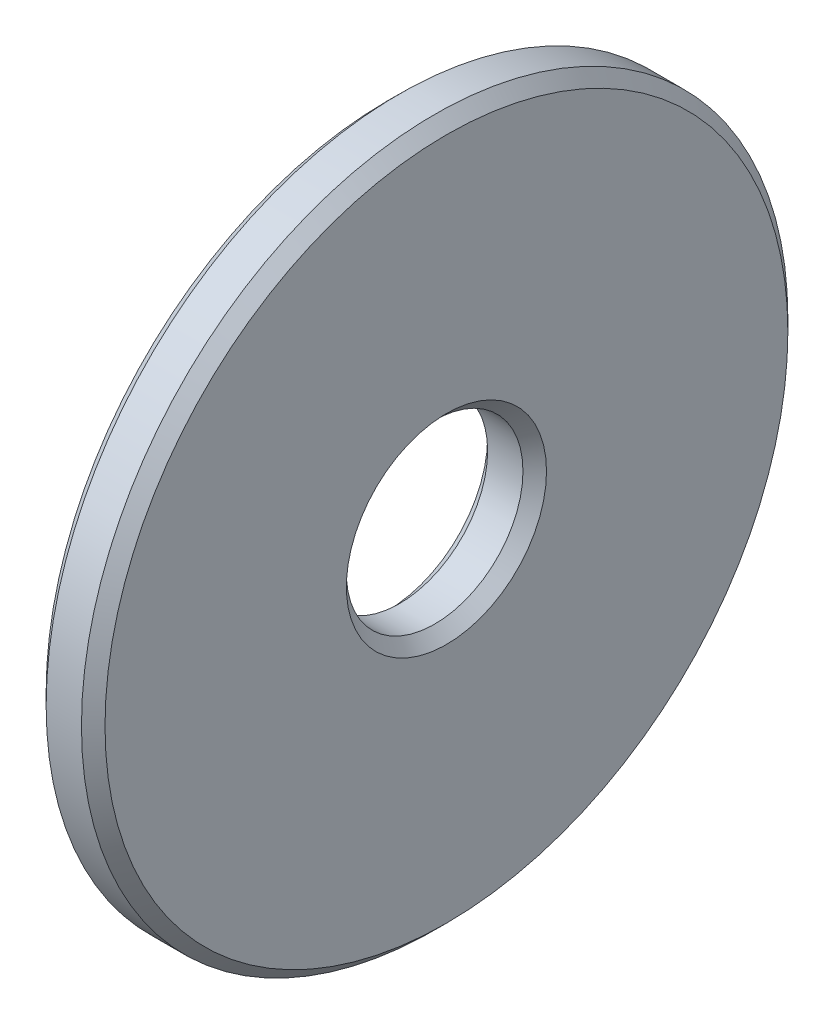
ISO-10303-21;
HEADER;
FILE_DESCRIPTION(('STEP AP214'),'2;1');
FILE_NAME('part.step','',(''),(''),'','','');
FILE_SCHEMA(('AUTOMOTIVE_DESIGN { 1 0 10303 214 1 1 1 1 }'));
ENDSEC;
DATA;
#1=APPLICATION_CONTEXT('core data for automotive mechanical design processes');
#2=APPLICATION_PROTOCOL_DEFINITION('international standard','automotive_design',2000,#1);
#3=PRODUCT_CONTEXT('',#1,'mechanical');
#4=PRODUCT('Part','Part','',(#3));
#5=PRODUCT_RELATED_PRODUCT_CATEGORY('part','',(#4));
#6=PRODUCT_DEFINITION_FORMATION('','',#4);
#7=PRODUCT_DEFINITION_CONTEXT('part definition',#1,'design');
#8=PRODUCT_DEFINITION('design','',#6,#7);
#9=PRODUCT_DEFINITION_SHAPE('','',#8);
#10=(LENGTH_UNIT() NAMED_UNIT(*) SI_UNIT(.MILLI.,.METRE.));
#11=(NAMED_UNIT(*) PLANE_ANGLE_UNIT() SI_UNIT($,.RADIAN.));
#12=(NAMED_UNIT(*) SI_UNIT($,.STERADIAN.) SOLID_ANGLE_UNIT());
#13=UNCERTAINTY_MEASURE_WITH_UNIT(LENGTH_MEASURE(1.E-05),#10,'distance_accuracy_value','');
#14=(GEOMETRIC_REPRESENTATION_CONTEXT(3) GLOBAL_UNCERTAINTY_ASSIGNED_CONTEXT((#13)) GLOBAL_UNIT_ASSIGNED_CONTEXT((#10,
#11,#12)) REPRESENTATION_CONTEXT('',''));
#15=CARTESIAN_POINT('',(0.,0.,0.));
#16=DIRECTION('',(0.,0.,1.));
#17=DIRECTION('',(1.,0.,0.));
#18=AXIS2_PLACEMENT_3D('',#15,#16,#17);
#19=CARTESIAN_POINT('',(0.2,0.,0.));
#20=DIRECTION('',(1.,0.,0.));
#21=DIRECTION('',(0.,0.,-1.));
#22=AXIS2_PLACEMENT_3D('',#19,#20,#21);
#23=CONICAL_SURFACE('',#22,6.,0.78539816339745);
#24=CARTESIAN_POINT('',(0.,0.,0.));
#25=DIRECTION('',(1.,0.,0.));
#26=DIRECTION('',(0.,0.,-1.));
#27=AXIS2_PLACEMENT_3D('',#24,#25,#26);
#28=CIRCLE('',#27,5.8);
#29=CARTESIAN_POINT('',(0.,0.,-5.8));
#30=VERTEX_POINT('',#29);
#31=EDGE_CURVE('E10',#30,#30,#28,.T.);
#32=ORIENTED_EDGE('',*,*,#31,.T.);
#33=EDGE_LOOP('',(#32));
#34=FACE_BOUND('',#33,.T.);
#35=CARTESIAN_POINT('',(0.2,0.,0.));
#36=DIRECTION('',(1.,0.,0.));
#37=DIRECTION('',(0.,0.,-1.));
#38=AXIS2_PLACEMENT_3D('',#35,#36,#37);
#39=CIRCLE('',#38,6.);
#40=CARTESIAN_POINT('',(0.2,0.,-6.));
#41=VERTEX_POINT('',#40);
#42=EDGE_CURVE('E59',#41,#41,#39,.T.);
#43=ORIENTED_EDGE('',*,*,#42,.F.);
#44=EDGE_LOOP('',(#43));
#45=FACE_BOUND('',#44,.T.);
#46=ADVANCED_FACE('F31',(#34,#45),#23,.T.);
#47=CARTESIAN_POINT('',(0.,5.8,0.));
#48=DIRECTION('',(-1.,0.,0.));
#49=DIRECTION('',(0.,0.,1.));
#50=AXIS2_PLACEMENT_3D('',#47,#48,#49);
#51=PLANE('',#50);
#52=CARTESIAN_POINT('',(0.,0.,0.));
#53=DIRECTION('',(1.,0.,0.));
#54=DIRECTION('',(0.,0.,-1.));
#55=AXIS2_PLACEMENT_3D('',#52,#53,#54);
#56=CIRCLE('',#55,1.7);
#57=CARTESIAN_POINT('',(0.,0.,-1.7));
#58=VERTEX_POINT('',#57);
#59=EDGE_CURVE('E37',#58,#58,#56,.T.);
#60=ORIENTED_EDGE('',*,*,#59,.T.);
#61=EDGE_LOOP('',(#60));
#62=FACE_BOUND('',#61,.T.);
#63=ORIENTED_EDGE('',*,*,#31,.F.);
#64=EDGE_LOOP('',(#63));
#65=FACE_BOUND('',#64,.T.);
#66=ADVANCED_FACE('F67',(#62,#65),#51,.T.);
#67=CARTESIAN_POINT('',(0.,0.,0.));
#68=DIRECTION('',(-1.,0.,0.));
#69=DIRECTION('',(0.,0.,1.));
#70=AXIS2_PLACEMENT_3D('',#67,#68,#69);
#71=CONICAL_SURFACE('',#70,1.7,0.785398163397448);
#72=CARTESIAN_POINT('',(0.2,0.,0.));
#73=DIRECTION('',(1.,0.,0.));
#74=DIRECTION('',(0.,0.,-1.));
#75=AXIS2_PLACEMENT_3D('',#72,#73,#74);
#76=CIRCLE('',#75,1.5);
#77=CARTESIAN_POINT('',(0.2,0.,-1.5));
#78=VERTEX_POINT('',#77);
#79=EDGE_CURVE('E41',#78,#78,#76,.T.);
#80=ORIENTED_EDGE('',*,*,#79,.T.);
#81=EDGE_LOOP('',(#80));
#82=FACE_BOUND('',#81,.T.);
#83=ORIENTED_EDGE('',*,*,#59,.F.);
#84=EDGE_LOOP('',(#83));
#85=FACE_BOUND('',#84,.T.);
#86=ADVANCED_FACE('F71',(#82,#85),#71,.F.);
#87=CARTESIAN_POINT('',(0.,0.,0.));
#88=DIRECTION('',(1.,0.,0.));
#89=DIRECTION('',(0.,0.,-1.));
#90=AXIS2_PLACEMENT_3D('',#87,#88,#89);
#91=CYLINDRICAL_SURFACE('',#90,1.5);
#92=CARTESIAN_POINT('',(0.8,0.,0.));
#93=DIRECTION('',(1.,0.,0.));
#94=DIRECTION('',(0.,0.,-1.));
#95=AXIS2_PLACEMENT_3D('',#92,#93,#94);
#96=CIRCLE('',#95,1.5);
#97=CARTESIAN_POINT('',(0.8,0.,-1.5));
#98=VERTEX_POINT('',#97);
#99=EDGE_CURVE('E45',#98,#98,#96,.T.);
#100=ORIENTED_EDGE('',*,*,#99,.T.);
#101=EDGE_LOOP('',(#100));
#102=FACE_BOUND('',#101,.T.);
#103=ORIENTED_EDGE('',*,*,#79,.F.);
#104=EDGE_LOOP('',(#103));
#105=FACE_BOUND('',#104,.T.);
#106=ADVANCED_FACE('F75',(#102,#105),#91,.F.);
#107=CARTESIAN_POINT('',(0.8,0.,0.));
#108=DIRECTION('',(1.,0.,0.));
#109=DIRECTION('',(0.,0.,-1.));
#110=AXIS2_PLACEMENT_3D('',#107,#108,#109);
#111=CONICAL_SURFACE('',#110,1.5,0.785398163397447);
#112=CARTESIAN_POINT('',(1.,0.,0.));
#113=DIRECTION('',(1.,0.,0.));
#114=DIRECTION('',(0.,0.,-1.));
#115=AXIS2_PLACEMENT_3D('',#112,#113,#114);
#116=CIRCLE('',#115,1.7);
#117=CARTESIAN_POINT('',(1.,0.,-1.7));
#118=VERTEX_POINT('',#117);
#119=EDGE_CURVE('E50',#118,#118,#116,.T.);
#120=ORIENTED_EDGE('',*,*,#119,.T.);
#121=EDGE_LOOP('',(#120));
#122=FACE_BOUND('',#121,.T.);
#123=ORIENTED_EDGE('',*,*,#99,.F.);
#124=EDGE_LOOP('',(#123));
#125=FACE_BOUND('',#124,.T.);
#126=ADVANCED_FACE('F82',(#122,#125),#111,.F.);
#127=CARTESIAN_POINT('',(1.,1.7,0.));
#128=DIRECTION('',(1.,0.,0.));
#129=DIRECTION('',(0.,0.,-1.));
#130=AXIS2_PLACEMENT_3D('',#127,#128,#129);
#131=PLANE('',#130);
#132=CARTESIAN_POINT('',(1.,0.,0.));
#133=DIRECTION('',(1.,0.,0.));
#134=DIRECTION('',(0.,0.,-1.));
#135=AXIS2_PLACEMENT_3D('',#132,#133,#134);
#136=CIRCLE('',#135,5.8);
#137=CARTESIAN_POINT('',(1.,0.,-5.8));
#138=VERTEX_POINT('',#137);
#139=EDGE_CURVE('E53',#138,#138,#136,.T.);
#140=ORIENTED_EDGE('',*,*,#139,.T.);
#141=EDGE_LOOP('',(#140));
#142=FACE_BOUND('',#141,.T.);
#143=ORIENTED_EDGE('',*,*,#119,.F.);
#144=EDGE_LOOP('',(#143));
#145=FACE_BOUND('',#144,.T.);
#146=ADVANCED_FACE('F86',(#142,#145),#131,.T.);
#147=CARTESIAN_POINT('',(1.,0.,0.));
#148=DIRECTION('',(-1.,0.,0.));
#149=DIRECTION('',(0.,0.,1.));
#150=AXIS2_PLACEMENT_3D('',#147,#148,#149);
#151=CONICAL_SURFACE('',#150,5.8,0.785398163397448);
#152=CARTESIAN_POINT('',(0.799999999999999,0.,0.));
#153=DIRECTION('',(1.,0.,0.));
#154=DIRECTION('',(0.,0.,-1.));
#155=AXIS2_PLACEMENT_3D('',#152,#153,#154);
#156=CIRCLE('',#155,6.);
#157=CARTESIAN_POINT('',(0.799999999999999,0.,-6.));
#158=VERTEX_POINT('',#157);
#159=EDGE_CURVE('E56',#158,#158,#156,.T.);
#160=ORIENTED_EDGE('',*,*,#159,.T.);
#161=EDGE_LOOP('',(#160));
#162=FACE_BOUND('',#161,.T.);
#163=ORIENTED_EDGE('',*,*,#139,.F.);
#164=EDGE_LOOP('',(#163));
#165=FACE_BOUND('',#164,.T.);
#166=ADVANCED_FACE('F90',(#162,#165),#151,.T.);
#167=CARTESIAN_POINT('',(0.,0.,0.));
#168=DIRECTION('',(1.,0.,0.));
#169=DIRECTION('',(0.,0.,-1.));
#170=AXIS2_PLACEMENT_3D('',#167,#168,#169);
#171=CYLINDRICAL_SURFACE('',#170,6.);
#172=ORIENTED_EDGE('',*,*,#42,.T.);
#173=EDGE_LOOP('',(#172));
#174=FACE_BOUND('',#173,.T.);
#175=ORIENTED_EDGE('',*,*,#159,.F.);
#176=EDGE_LOOP('',(#175));
#177=FACE_BOUND('',#176,.T.);
#178=ADVANCED_FACE('F63',(#174,#177),#171,.T.);
#179=CLOSED_SHELL('',(#46,#66,#86,#106,#126,#146,#166,#178));
#180=MANIFOLD_SOLID_BREP('B2',#179);
#181=ADVANCED_BREP_SHAPE_REPRESENTATION('',(#18,#180),#14);
#182=SHAPE_DEFINITION_REPRESENTATION(#9,#181);
ENDSEC;
END-ISO-10303-21;
